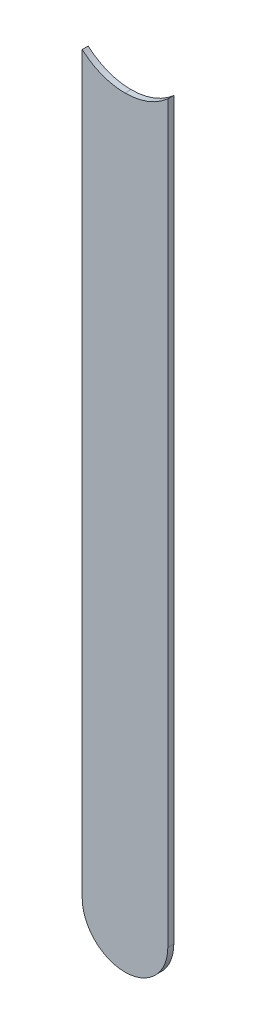
ISO-10303-21;
HEADER;
FILE_DESCRIPTION(('STEP AP214'),'2;1');
FILE_NAME('part.step','',(''),(''),'','','');
FILE_SCHEMA(('AUTOMOTIVE_DESIGN { 1 0 10303 214 1 1 1 1 }'));
ENDSEC;
DATA;
#1=APPLICATION_CONTEXT('core data for automotive mechanical design processes');
#2=APPLICATION_PROTOCOL_DEFINITION('international standard','automotive_design',2000,#1);
#3=PRODUCT_CONTEXT('',#1,'mechanical');
#4=PRODUCT('Part','Part','',(#3));
#5=PRODUCT_RELATED_PRODUCT_CATEGORY('part','',(#4));
#6=PRODUCT_DEFINITION_FORMATION('','',#4);
#7=PRODUCT_DEFINITION_CONTEXT('part definition',#1,'design');
#8=PRODUCT_DEFINITION('design','',#6,#7);
#9=PRODUCT_DEFINITION_SHAPE('','',#8);
#10=(LENGTH_UNIT() NAMED_UNIT(*) SI_UNIT(.MILLI.,.METRE.));
#11=(NAMED_UNIT(*) PLANE_ANGLE_UNIT() SI_UNIT($,.RADIAN.));
#12=(NAMED_UNIT(*) SI_UNIT($,.STERADIAN.) SOLID_ANGLE_UNIT());
#13=UNCERTAINTY_MEASURE_WITH_UNIT(LENGTH_MEASURE(1.E-05),#10,'distance_accuracy_value','');
#14=(GEOMETRIC_REPRESENTATION_CONTEXT(3) GLOBAL_UNCERTAINTY_ASSIGNED_CONTEXT((#13)) GLOBAL_UNIT_ASSIGNED_CONTEXT((#10,
#11,#12)) REPRESENTATION_CONTEXT('',''));
#15=CARTESIAN_POINT('',(0.,0.,0.));
#16=DIRECTION('',(0.,0.,1.));
#17=DIRECTION('',(1.,0.,0.));
#18=AXIS2_PLACEMENT_3D('',#15,#16,#17);
#19=CARTESIAN_POINT('',(170.43,-124.968,-0.035));
#20=DIRECTION('',(-1.,0.,0.));
#21=DIRECTION('',(0.,0.,1.));
#22=AXIS2_PLACEMENT_3D('',#19,#20,#21);
#23=PLANE('',#22);
#24=DIRECTION('',(0.,0.,-1.));
#25=VECTOR('',#24,1.);
#26=CARTESIAN_POINT('',(170.43,-120.6755084971,-0.045));
#27=LINE('',#26,#25);
#28=CARTESIAN_POINT('',(170.43,-120.6755084971,0.));
#29=VERTEX_POINT('',#28);
#30=CARTESIAN_POINT('',(170.43,-120.6755084971,-0.035));
#31=VERTEX_POINT('',#30);
#32=EDGE_CURVE('E11',#29,#31,#27,.T.);
#33=ORIENTED_EDGE('',*,*,#32,.F.);
#34=DIRECTION('',(0.,1.,0.));
#35=VECTOR('',#34,1.);
#36=CARTESIAN_POINT('',(170.43,-124.968,0.));
#37=LINE('',#36,#35);
#38=CARTESIAN_POINT('',(170.43,-124.968,0.));
#39=VERTEX_POINT('',#38);
#40=EDGE_CURVE('E128',#39,#29,#37,.T.);
#41=ORIENTED_EDGE('',*,*,#40,.F.);
#42=DIRECTION('',(0.,0.,1.));
#43=VECTOR('',#42,1.);
#44=CARTESIAN_POINT('',(170.43,-124.968,-0.035));
#45=LINE('',#44,#43);
#46=CARTESIAN_POINT('',(170.43,-124.968,-0.035));
#47=VERTEX_POINT('',#46);
#48=EDGE_CURVE('E84',#47,#39,#45,.T.);
#49=ORIENTED_EDGE('',*,*,#48,.F.);
#50=DIRECTION('',(0.,1.,0.));
#51=VECTOR('',#50,1.);
#52=CARTESIAN_POINT('',(170.43,-124.968,-0.035));
#53=LINE('',#52,#51);
#54=EDGE_CURVE('E117',#47,#31,#53,.T.);
#55=ORIENTED_EDGE('',*,*,#54,.T.);
#56=EDGE_LOOP('',(#33,#41,#49,#55));
#57=FACE_BOUND('',#56,.T.);
#58=ADVANCED_FACE('F17',(#57),#23,.F.);
#59=CARTESIAN_POINT('',(170.18,-120.396,-0.045));
#60=DIRECTION('',(0.,0.,-1.));
#61=DIRECTION('',(0.,-1.,0.));
#62=AXIS2_PLACEMENT_3D('',#59,#60,#61);
#63=CYLINDRICAL_SURFACE('',#62,0.375);
#64=CARTESIAN_POINT('',(170.18,-120.396,-0.035));
#65=DIRECTION('',(0.,0.,-1.));
#66=DIRECTION('',(0.,-1.,0.));
#67=AXIS2_PLACEMENT_3D('',#64,#65,#66);
#68=CIRCLE('',#67,0.375);
#69=CARTESIAN_POINT('',(170.18,-120.771,-0.035));
#70=VERTEX_POINT('',#69);
#71=EDGE_CURVE('E112',#31,#70,#68,.T.);
#72=ORIENTED_EDGE('',*,*,#71,.T.);
#73=DIRECTION('',(0.,0.,1.));
#74=VECTOR('',#73,1.);
#75=CARTESIAN_POINT('',(170.18,-120.771,-0.045));
#76=LINE('',#75,#74);
#77=CARTESIAN_POINT('',(170.18,-120.771,0.));
#78=VERTEX_POINT('',#77);
#79=EDGE_CURVE('E25',#70,#78,#76,.T.);
#80=ORIENTED_EDGE('',*,*,#79,.T.);
#81=CARTESIAN_POINT('',(170.18,-120.396,0.));
#82=DIRECTION('',(0.,0.,-1.));
#83=DIRECTION('',(0.,-1.,0.));
#84=AXIS2_PLACEMENT_3D('',#81,#82,#83);
#85=CIRCLE('',#84,0.375);
#86=EDGE_CURVE('E131',#29,#78,#85,.T.);
#87=ORIENTED_EDGE('',*,*,#86,.F.);
#88=ORIENTED_EDGE('',*,*,#32,.T.);
#89=EDGE_LOOP('',(#72,#80,#87,#88));
#90=FACE_BOUND('',#89,.T.);
#91=ADVANCED_FACE('F224',(#90),#63,.F.);
#92=CARTESIAN_POINT('',(170.18,-120.396,-0.045));
#93=DIRECTION('',(0.,0.,-1.));
#94=DIRECTION('',(0.,-1.,0.));
#95=AXIS2_PLACEMENT_3D('',#92,#93,#94);
#96=CYLINDRICAL_SURFACE('',#95,0.375);
#97=ORIENTED_EDGE('',*,*,#79,.F.);
#98=CARTESIAN_POINT('',(170.18,-120.396,-0.035));
#99=DIRECTION('',(0.,0.,-1.));
#100=DIRECTION('',(0.,-1.,0.));
#101=AXIS2_PLACEMENT_3D('',#98,#99,#100);
#102=CIRCLE('',#101,0.375);
#103=CARTESIAN_POINT('',(169.93,-120.6755084972,-0.035));
#104=VERTEX_POINT('',#103);
#105=EDGE_CURVE('E120',#70,#104,#102,.T.);
#106=ORIENTED_EDGE('',*,*,#105,.T.);
#107=DIRECTION('',(0.,0.,-1.));
#108=VECTOR('',#107,1.);
#109=CARTESIAN_POINT('',(169.93,-120.6755084971,-0.045));
#110=LINE('',#109,#108);
#111=CARTESIAN_POINT('',(169.93,-120.6755084972,0.));
#112=VERTEX_POINT('',#111);
#113=EDGE_CURVE('E98',#112,#104,#110,.T.);
#114=ORIENTED_EDGE('',*,*,#113,.F.);
#115=CARTESIAN_POINT('',(170.18,-120.396,0.));
#116=DIRECTION('',(0.,0.,-1.));
#117=DIRECTION('',(0.,-1.,0.));
#118=AXIS2_PLACEMENT_3D('',#115,#116,#117);
#119=CIRCLE('',#118,0.375);
#120=EDGE_CURVE('E88',#78,#112,#119,.T.);
#121=ORIENTED_EDGE('',*,*,#120,.F.);
#122=EDGE_LOOP('',(#97,#106,#114,#121));
#123=FACE_BOUND('',#122,.T.);
#124=ADVANCED_FACE('F217',(#123),#96,.F.);
#125=CARTESIAN_POINT('',(169.93,-120.396,0.));
#126=DIRECTION('',(0.,0.,1.));
#127=DIRECTION('',(1.,0.,0.));
#128=AXIS2_PLACEMENT_3D('',#125,#126,#127);
#129=PLANE('',#128);
#130=ORIENTED_EDGE('',*,*,#120,.T.);
#131=DIRECTION('',(0.,-1.,0.));
#132=VECTOR('',#131,1.);
#133=CARTESIAN_POINT('',(169.93,-120.396,0.));
#134=LINE('',#133,#132);
#135=CARTESIAN_POINT('',(169.93,-124.968,0.));
#136=VERTEX_POINT('',#135);
#137=EDGE_CURVE('E91',#112,#136,#134,.T.);
#138=ORIENTED_EDGE('',*,*,#137,.T.);
#139=CARTESIAN_POINT('',(170.18,-124.968,0.));
#140=DIRECTION('',(0.,0.,1.));
#141=DIRECTION('',(-1.,0.,0.));
#142=AXIS2_PLACEMENT_3D('',#139,#140,#141);
#143=CIRCLE('',#142,0.25);
#144=EDGE_CURVE('E78',#136,#39,#143,.T.);
#145=ORIENTED_EDGE('',*,*,#144,.T.);
#146=ORIENTED_EDGE('',*,*,#40,.T.);
#147=ORIENTED_EDGE('',*,*,#86,.T.);
#148=EDGE_LOOP('',(#130,#138,#145,#146,#147));
#149=FACE_BOUND('',#148,.T.);
#150=ADVANCED_FACE('F92',(#149),#129,.T.);
#151=CARTESIAN_POINT('',(170.18,-124.968,-0.035));
#152=DIRECTION('',(0.,0.,-1.));
#153=DIRECTION('',(-1.,0.,0.));
#154=AXIS2_PLACEMENT_3D('',#151,#152,#153);
#155=CYLINDRICAL_SURFACE('',#154,0.25);
#156=CARTESIAN_POINT('',(170.18,-124.968,-0.035));
#157=DIRECTION('',(0.,0.,1.));
#158=DIRECTION('',(-1.,0.,0.));
#159=AXIS2_PLACEMENT_3D('',#156,#157,#158);
#160=CIRCLE('',#159,0.25);
#161=CARTESIAN_POINT('',(169.93,-124.968,-0.035));
#162=VERTEX_POINT('',#161);
#163=EDGE_CURVE('E123',#162,#47,#160,.T.);
#164=ORIENTED_EDGE('',*,*,#163,.T.);
#165=ORIENTED_EDGE('',*,*,#48,.T.);
#166=ORIENTED_EDGE('',*,*,#144,.F.);
#167=DIRECTION('',(0.,0.,1.));
#168=VECTOR('',#167,1.);
#169=CARTESIAN_POINT('',(169.93,-124.968,-0.035));
#170=LINE('',#169,#168);
#171=EDGE_CURVE('E83',#162,#136,#170,.T.);
#172=ORIENTED_EDGE('',*,*,#171,.F.);
#173=EDGE_LOOP('',(#164,#165,#166,#172));
#174=FACE_BOUND('',#173,.T.);
#175=ADVANCED_FACE('F81',(#174),#155,.T.);
#176=CARTESIAN_POINT('',(169.93,-120.396,-0.035));
#177=DIRECTION('',(0.,0.,1.));
#178=DIRECTION('',(1.,0.,0.));
#179=AXIS2_PLACEMENT_3D('',#176,#177,#178);
#180=PLANE('',#179);
#181=ORIENTED_EDGE('',*,*,#71,.F.);
#182=ORIENTED_EDGE('',*,*,#54,.F.);
#183=ORIENTED_EDGE('',*,*,#163,.F.);
#184=DIRECTION('',(0.,-1.,0.));
#185=VECTOR('',#184,1.);
#186=CARTESIAN_POINT('',(169.93,-120.396,-0.035));
#187=LINE('',#186,#185);
#188=EDGE_CURVE('E103',#104,#162,#187,.T.);
#189=ORIENTED_EDGE('',*,*,#188,.F.);
#190=ORIENTED_EDGE('',*,*,#105,.F.);
#191=EDGE_LOOP('',(#181,#182,#183,#189,#190));
#192=FACE_BOUND('',#191,.T.);
#193=ADVANCED_FACE('F188',(#192),#180,.F.);
#194=CARTESIAN_POINT('',(169.93,-120.396,-0.035));
#195=DIRECTION('',(1.,0.,0.));
#196=DIRECTION('',(0.,1.,0.));
#197=AXIS2_PLACEMENT_3D('',#194,#195,#196);
#198=PLANE('',#197);
#199=ORIENTED_EDGE('',*,*,#171,.T.);
#200=ORIENTED_EDGE('',*,*,#137,.F.);
#201=ORIENTED_EDGE('',*,*,#113,.T.);
#202=ORIENTED_EDGE('',*,*,#188,.T.);
#203=EDGE_LOOP('',(#199,#200,#201,#202));
#204=FACE_BOUND('',#203,.T.);
#205=ADVANCED_FACE('F101',(#204),#198,.F.);
#206=CLOSED_SHELL('',(#58,#91,#124,#150,#175,#193,#205));
#207=MANIFOLD_SOLID_BREP('B1',#206);
#208=ADVANCED_BREP_SHAPE_REPRESENTATION('',(#18,#207),#14);
#209=SHAPE_DEFINITION_REPRESENTATION(#9,#208);
ENDSEC;
END-ISO-10303-21;
